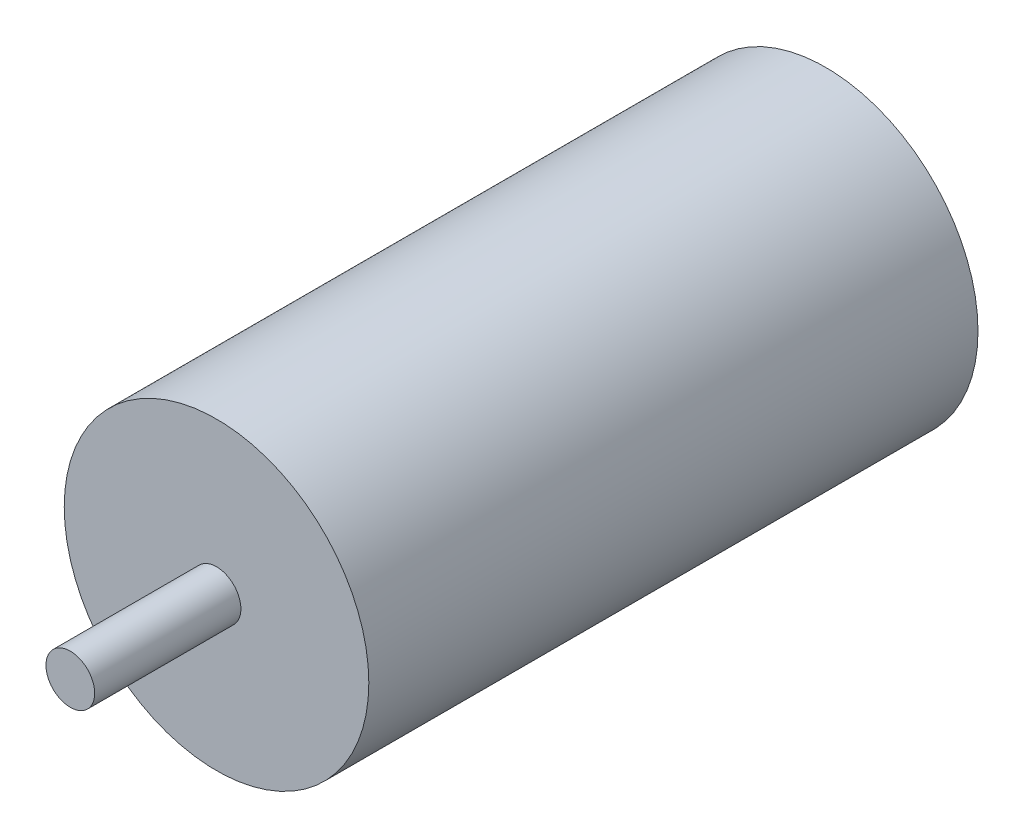
ISO-10303-21;
HEADER;
FILE_DESCRIPTION(('STEP AP214'),'2;1');
FILE_NAME('part.step','',(''),(''),'','','');
FILE_SCHEMA(('AUTOMOTIVE_DESIGN { 1 0 10303 214 1 1 1 1 }'));
ENDSEC;
DATA;
#1=APPLICATION_CONTEXT('core data for automotive mechanical design processes');
#2=APPLICATION_PROTOCOL_DEFINITION('international standard','automotive_design',2000,#1);
#3=PRODUCT_CONTEXT('',#1,'mechanical');
#4=PRODUCT('Part','Part','',(#3));
#5=PRODUCT_RELATED_PRODUCT_CATEGORY('part','',(#4));
#6=PRODUCT_DEFINITION_FORMATION('','',#4);
#7=PRODUCT_DEFINITION_CONTEXT('part definition',#1,'design');
#8=PRODUCT_DEFINITION('design','',#6,#7);
#9=PRODUCT_DEFINITION_SHAPE('','',#8);
#10=(LENGTH_UNIT() NAMED_UNIT(*) SI_UNIT(.MILLI.,.METRE.));
#11=(NAMED_UNIT(*) PLANE_ANGLE_UNIT() SI_UNIT($,.RADIAN.));
#12=(NAMED_UNIT(*) SI_UNIT($,.STERADIAN.) SOLID_ANGLE_UNIT());
#13=UNCERTAINTY_MEASURE_WITH_UNIT(LENGTH_MEASURE(1.E-05),#10,'distance_accuracy_value','');
#14=(GEOMETRIC_REPRESENTATION_CONTEXT(3) GLOBAL_UNCERTAINTY_ASSIGNED_CONTEXT((#13)) GLOBAL_UNIT_ASSIGNED_CONTEXT((#10,
#11,#12)) REPRESENTATION_CONTEXT('',''));
#15=CARTESIAN_POINT('',(0.,0.,0.));
#16=DIRECTION('',(0.,0.,1.));
#17=DIRECTION('',(1.,0.,0.));
#18=AXIS2_PLACEMENT_3D('',#15,#16,#17);
#19=CARTESIAN_POINT('',(0.,0.,50.));
#20=DIRECTION('',(0.,0.,-1.));
#21=DIRECTION('',(-1.,0.,0.));
#22=AXIS2_PLACEMENT_3D('',#19,#20,#21);
#23=CYLINDRICAL_SURFACE('',#22,12.5);
#24=CARTESIAN_POINT('',(0.,0.,50.));
#25=DIRECTION('',(0.,0.,1.));
#26=DIRECTION('',(1.,0.,0.));
#27=AXIS2_PLACEMENT_3D('',#24,#25,#26);
#28=CIRCLE('',#27,12.5);
#29=CARTESIAN_POINT('',(12.5,0.,50.));
#30=VERTEX_POINT('',#29);
#31=EDGE_CURVE('E38',#30,#30,#28,.T.);
#32=ORIENTED_EDGE('',*,*,#31,.F.);
#33=EDGE_LOOP('',(#32));
#34=FACE_BOUND('',#33,.T.);
#35=CARTESIAN_POINT('',(0.,0.,0.));
#36=DIRECTION('',(0.,0.,1.));
#37=DIRECTION('',(1.,0.,0.));
#38=AXIS2_PLACEMENT_3D('',#35,#36,#37);
#39=CIRCLE('',#38,12.5);
#40=CARTESIAN_POINT('',(12.5,0.,0.));
#41=VERTEX_POINT('',#40);
#42=EDGE_CURVE('E34',#41,#41,#39,.T.);
#43=ORIENTED_EDGE('',*,*,#42,.T.);
#44=EDGE_LOOP('',(#43));
#45=FACE_BOUND('',#44,.T.);
#46=ADVANCED_FACE('F31',(#34,#45),#23,.T.);
#47=CARTESIAN_POINT('',(0.,0.,50.));
#48=DIRECTION('',(0.,0.,1.));
#49=DIRECTION('',(1.,0.,0.));
#50=AXIS2_PLACEMENT_3D('',#47,#48,#49);
#51=PLANE('',#50);
#52=CARTESIAN_POINT('',(0.,0.,50.));
#53=DIRECTION('',(0.,0.,1.));
#54=DIRECTION('',(1.,0.,0.));
#55=AXIS2_PLACEMENT_3D('',#52,#53,#54);
#56=CIRCLE('',#55,2.);
#57=CARTESIAN_POINT('',(2.,0.,50.));
#58=VERTEX_POINT('',#57);
#59=EDGE_CURVE('E10',#58,#58,#56,.T.);
#60=ORIENTED_EDGE('',*,*,#59,.F.);
#61=EDGE_LOOP('',(#60));
#62=FACE_BOUND('',#61,.T.);
#63=ORIENTED_EDGE('',*,*,#31,.T.);
#64=EDGE_LOOP('',(#63));
#65=FACE_BOUND('',#64,.T.);
#66=ADVANCED_FACE('F55',(#62,#65),#51,.T.);
#67=CARTESIAN_POINT('',(0.,0.,0.));
#68=DIRECTION('',(0.,0.,1.));
#69=DIRECTION('',(1.,0.,0.));
#70=AXIS2_PLACEMENT_3D('',#67,#68,#69);
#71=PLANE('',#70);
#72=ORIENTED_EDGE('',*,*,#42,.F.);
#73=EDGE_LOOP('',(#72));
#74=FACE_BOUND('',#73,.T.);
#75=ADVANCED_FACE('F52',(#74),#71,.F.);
#76=CARTESIAN_POINT('',(0.,0.,62.));
#77=DIRECTION('',(0.,0.,-1.));
#78=DIRECTION('',(-1.,0.,0.));
#79=AXIS2_PLACEMENT_3D('',#76,#77,#78);
#80=CYLINDRICAL_SURFACE('',#79,2.);
#81=CARTESIAN_POINT('',(0.,0.,62.));
#82=DIRECTION('',(0.,0.,1.));
#83=DIRECTION('',(1.,0.,0.));
#84=AXIS2_PLACEMENT_3D('',#81,#82,#83);
#85=CIRCLE('',#84,2.);
#86=CARTESIAN_POINT('',(2.,0.,62.));
#87=VERTEX_POINT('',#86);
#88=EDGE_CURVE('E44',#87,#87,#85,.T.);
#89=ORIENTED_EDGE('',*,*,#88,.F.);
#90=EDGE_LOOP('',(#89));
#91=FACE_BOUND('',#90,.T.);
#92=ORIENTED_EDGE('',*,*,#59,.T.);
#93=EDGE_LOOP('',(#92));
#94=FACE_BOUND('',#93,.T.);
#95=ADVANCED_FACE('F54',(#91,#94),#80,.T.);
#96=CARTESIAN_POINT('',(0.,0.,62.));
#97=DIRECTION('',(0.,0.,1.));
#98=DIRECTION('',(1.,0.,0.));
#99=AXIS2_PLACEMENT_3D('',#96,#97,#98);
#100=PLANE('',#99);
#101=ORIENTED_EDGE('',*,*,#88,.T.);
#102=EDGE_LOOP('',(#101));
#103=FACE_BOUND('',#102,.T.);
#104=ADVANCED_FACE('F60',(#103),#100,.T.);
#105=CLOSED_SHELL('',(#46,#66,#75,#95,#104));
#106=MANIFOLD_SOLID_BREP('B2',#105);
#107=ADVANCED_BREP_SHAPE_REPRESENTATION('',(#18,#106),#14);
#108=SHAPE_DEFINITION_REPRESENTATION(#9,#107);
ENDSEC;
END-ISO-10303-21;
